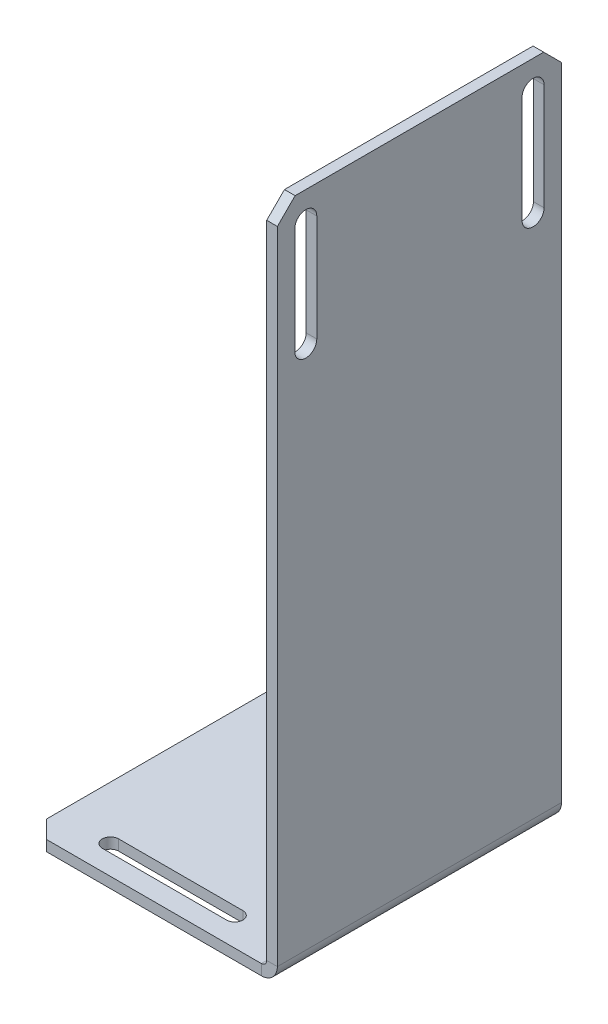
ISO-10303-21;
HEADER;
FILE_DESCRIPTION(('STEP AP214'),'2;1');
FILE_NAME('part.step','',(''),(''),'','','');
FILE_SCHEMA(('AUTOMOTIVE_DESIGN { 1 0 10303 214 1 1 1 1 }'));
ENDSEC;
DATA;
#1=APPLICATION_CONTEXT('core data for automotive mechanical design processes');
#2=APPLICATION_PROTOCOL_DEFINITION('international standard','automotive_design',2000,#1);
#3=PRODUCT_CONTEXT('',#1,'mechanical');
#4=PRODUCT('Part','Part','',(#3));
#5=PRODUCT_RELATED_PRODUCT_CATEGORY('part','',(#4));
#6=PRODUCT_DEFINITION_FORMATION('','',#4);
#7=PRODUCT_DEFINITION_CONTEXT('part definition',#1,'design');
#8=PRODUCT_DEFINITION('design','',#6,#7);
#9=PRODUCT_DEFINITION_SHAPE('','',#8);
#10=(LENGTH_UNIT() NAMED_UNIT(*) SI_UNIT(.MILLI.,.METRE.));
#11=(NAMED_UNIT(*) PLANE_ANGLE_UNIT() SI_UNIT($,.RADIAN.));
#12=(NAMED_UNIT(*) SI_UNIT($,.STERADIAN.) SOLID_ANGLE_UNIT());
#13=UNCERTAINTY_MEASURE_WITH_UNIT(LENGTH_MEASURE(1.E-05),#10,'distance_accuracy_value','');
#14=(GEOMETRIC_REPRESENTATION_CONTEXT(3) GLOBAL_UNCERTAINTY_ASSIGNED_CONTEXT((#13)) GLOBAL_UNIT_ASSIGNED_CONTEXT((#10,
#11,#12)) REPRESENTATION_CONTEXT('',''));
#15=CARTESIAN_POINT('',(0.,0.,0.));
#16=DIRECTION('',(0.,0.,1.));
#17=DIRECTION('',(1.,0.,0.));
#18=AXIS2_PLACEMENT_3D('',#15,#16,#17);
#19=CARTESIAN_POINT('',(0.,2.99999999999998,40.));
#20=DIRECTION('',(0.,-1.,0.));
#21=DIRECTION('',(1.,0.,0.));
#22=AXIS2_PLACEMENT_3D('',#19,#20,#21);
#23=PLANE('',#22);
#24=DIRECTION('',(-1.,0.,0.));
#25=VECTOR('',#24,1.);
#26=CARTESIAN_POINT('',(0.,2.99999999999998,-40.));
#27=LINE('',#26,#25);
#28=CARTESIAN_POINT('',(-4.50000000000002,3.00000000000003,-40.));
#29=VERTEX_POINT('',#28);
#30=CARTESIAN_POINT('',(-65.,2.99999999999998,-40.));
#31=VERTEX_POINT('',#30);
#32=EDGE_CURVE('E357',#29,#31,#27,.T.);
#33=ORIENTED_EDGE('',*,*,#32,.T.);
#34=DIRECTION('',(-0.707106781186548,0.,0.707106781186548));
#35=VECTOR('',#34,1.);
#36=CARTESIAN_POINT('',(-65.,2.99999999999998,-40.));
#37=LINE('',#36,#35);
#38=CARTESIAN_POINT('',(-70.,2.99999999999998,-35.));
#39=VERTEX_POINT('',#38);
#40=EDGE_CURVE('E434',#31,#39,#37,.T.);
#41=ORIENTED_EDGE('',*,*,#40,.T.);
#42=DIRECTION('',(0.,0.,-1.));
#43=VECTOR('',#42,1.);
#44=CARTESIAN_POINT('',(-70.,2.99999999999995,40.));
#45=LINE('',#44,#43);
#46=CARTESIAN_POINT('',(-70.,2.99999999999995,35.));
#47=VERTEX_POINT('',#46);
#48=EDGE_CURVE('E416',#47,#39,#45,.T.);
#49=ORIENTED_EDGE('',*,*,#48,.F.);
#50=DIRECTION('',(-0.707106781186549,0.,-0.707106781186546));
#51=VECTOR('',#50,1.);
#52=CARTESIAN_POINT('',(-70.,2.99999999999995,35.));
#53=LINE('',#52,#51);
#54=CARTESIAN_POINT('',(-65.,2.99999999999998,40.));
#55=VERTEX_POINT('',#54);
#56=EDGE_CURVE('E432',#47,#55,#53,.F.);
#57=ORIENTED_EDGE('',*,*,#56,.T.);
#58=DIRECTION('',(-1.,0.,0.));
#59=VECTOR('',#58,1.);
#60=CARTESIAN_POINT('',(0.,2.99999999999998,40.));
#61=LINE('',#60,#59);
#62=CARTESIAN_POINT('',(-4.50000000000003,3.00000000000003,40.));
#63=VERTEX_POINT('',#62);
#64=EDGE_CURVE('E364',#63,#55,#61,.T.);
#65=ORIENTED_EDGE('',*,*,#64,.F.);
#66=DIRECTION('',(0.,0.,-1.));
#67=VECTOR('',#66,1.);
#68=CARTESIAN_POINT('',(-4.50000000000003,3.00000000000003,40.));
#69=LINE('',#68,#67);
#70=EDGE_CURVE('E381',#63,#29,#69,.T.);
#71=ORIENTED_EDGE('',*,*,#70,.T.);
#72=EDGE_LOOP('',(#33,#41,#49,#57,#65,#71));
#73=FACE_BOUND('',#72,.T.);
#74=DIRECTION('',(1.,0.,0.));
#75=VECTOR('',#74,1.);
#76=CARTESIAN_POINT('',(-55.,2.99999999999998,-29.6999999999999));
#77=LINE('',#76,#75);
#78=CARTESIAN_POINT('',(-55.,2.99999999999998,-29.6999999999999));
#79=VERTEX_POINT('',#78);
#80=CARTESIAN_POINT('',(-20.,2.99999999999998,-29.6999999999999));
#81=VERTEX_POINT('',#80);
#82=EDGE_CURVE('E315',#79,#81,#77,.T.);
#83=ORIENTED_EDGE('',*,*,#82,.F.);
#84=CARTESIAN_POINT('',(-55.,2.99999999999998,-32.));
#85=DIRECTION('',(0.,1.,0.));
#86=DIRECTION('',(-1.,0.,0.));
#87=AXIS2_PLACEMENT_3D('',#84,#85,#86);
#88=CIRCLE('',#87,2.3);
#89=CARTESIAN_POINT('',(-55.,2.99999999999998,-34.3));
#90=VERTEX_POINT('',#89);
#91=EDGE_CURVE('E294',#90,#79,#88,.T.);
#92=ORIENTED_EDGE('',*,*,#91,.F.);
#93=DIRECTION('',(1.,0.,0.));
#94=VECTOR('',#93,1.);
#95=CARTESIAN_POINT('',(-55.,2.99999999999998,-34.3));
#96=LINE('',#95,#94);
#97=CARTESIAN_POINT('',(-20.,2.99999999999998,-34.3));
#98=VERTEX_POINT('',#97);
#99=EDGE_CURVE('E305',#90,#98,#96,.T.);
#100=ORIENTED_EDGE('',*,*,#99,.T.);
#101=CARTESIAN_POINT('',(-20.,2.99999999999998,-32.));
#102=DIRECTION('',(0.,1.,0.));
#103=DIRECTION('',(-1.,0.,0.));
#104=AXIS2_PLACEMENT_3D('',#101,#102,#103);
#105=CIRCLE('',#104,2.30000000000001);
#106=EDGE_CURVE('E318',#81,#98,#105,.T.);
#107=ORIENTED_EDGE('',*,*,#106,.F.);
#108=EDGE_LOOP('',(#83,#92,#100,#107));
#109=FACE_BOUND('',#108,.T.);
#110=CARTESIAN_POINT('',(-55.,3.,32.));
#111=DIRECTION('',(0.,-1.,0.));
#112=DIRECTION('',(-1.,0.,0.));
#113=AXIS2_PLACEMENT_3D('',#110,#111,#112);
#114=CIRCLE('',#113,2.3);
#115=CARTESIAN_POINT('',(-55.,3.,34.3));
#116=VERTEX_POINT('',#115);
#117=CARTESIAN_POINT('',(-55.,3.,29.7000000000001));
#118=VERTEX_POINT('',#117);
#119=EDGE_CURVE('E66',#116,#118,#114,.T.);
#120=ORIENTED_EDGE('',*,*,#119,.T.);
#121=DIRECTION('',(1.,0.,0.));
#122=VECTOR('',#121,1.);
#123=CARTESIAN_POINT('',(-55.,3.,29.7000000000001));
#124=LINE('',#123,#122);
#125=CARTESIAN_POINT('',(-20.,2.99999999999998,29.6999999999999));
#126=VERTEX_POINT('',#125);
#127=EDGE_CURVE('E251',#118,#126,#124,.T.);
#128=ORIENTED_EDGE('',*,*,#127,.T.);
#129=CARTESIAN_POINT('',(-20.,2.99999999999998,32.));
#130=DIRECTION('',(0.,-1.,0.));
#131=DIRECTION('',(-1.,0.,0.));
#132=AXIS2_PLACEMENT_3D('',#129,#130,#131);
#133=CIRCLE('',#132,2.30000000000001);
#134=CARTESIAN_POINT('',(-20.,2.99999999999998,34.3));
#135=VERTEX_POINT('',#134);
#136=EDGE_CURVE('E254',#126,#135,#133,.T.);
#137=ORIENTED_EDGE('',*,*,#136,.T.);
#138=DIRECTION('',(1.,0.,0.));
#139=VECTOR('',#138,1.);
#140=CARTESIAN_POINT('',(-55.,3.,34.3));
#141=LINE('',#140,#139);
#142=EDGE_CURVE('E260',#116,#135,#141,.T.);
#143=ORIENTED_EDGE('',*,*,#142,.F.);
#144=EDGE_LOOP('',(#120,#128,#137,#143));
#145=FACE_BOUND('',#144,.T.);
#146=ADVANCED_FACE('F51',(#73,#109,#145),#23,.F.);
#147=CARTESIAN_POINT('',(0.,0.,40.));
#148=DIRECTION('',(0.,-1.,0.));
#149=DIRECTION('',(1.,0.,0.));
#150=AXIS2_PLACEMENT_3D('',#147,#148,#149);
#151=PLANE('',#150);
#152=CARTESIAN_POINT('',(-55.,0.,-32.));
#153=DIRECTION('',(0.,1.,0.));
#154=DIRECTION('',(-1.,0.,0.));
#155=AXIS2_PLACEMENT_3D('',#152,#153,#154);
#156=CIRCLE('',#155,2.3);
#157=CARTESIAN_POINT('',(-55.,0.,-34.3));
#158=VERTEX_POINT('',#157);
#159=CARTESIAN_POINT('',(-55.,0.,-29.6999999999999));
#160=VERTEX_POINT('',#159);
#161=EDGE_CURVE('E301',#158,#160,#156,.T.);
#162=ORIENTED_EDGE('',*,*,#161,.T.);
#163=DIRECTION('',(1.,0.,0.));
#164=VECTOR('',#163,1.);
#165=CARTESIAN_POINT('',(-55.,0.,-29.6999999999999));
#166=LINE('',#165,#164);
#167=CARTESIAN_POINT('',(-20.,0.,-29.6999999999999));
#168=VERTEX_POINT('',#167);
#169=EDGE_CURVE('E304',#160,#168,#166,.T.);
#170=ORIENTED_EDGE('',*,*,#169,.T.);
#171=CARTESIAN_POINT('',(-20.,0.,-32.));
#172=DIRECTION('',(0.,1.,0.));
#173=DIRECTION('',(-1.,0.,0.));
#174=AXIS2_PLACEMENT_3D('',#171,#172,#173);
#175=CIRCLE('',#174,2.30000000000001);
#176=CARTESIAN_POINT('',(-20.,0.,-34.3));
#177=VERTEX_POINT('',#176);
#178=EDGE_CURVE('E308',#168,#177,#175,.T.);
#179=ORIENTED_EDGE('',*,*,#178,.T.);
#180=DIRECTION('',(1.,0.,0.));
#181=VECTOR('',#180,1.);
#182=CARTESIAN_POINT('',(-55.,0.,-34.3));
#183=LINE('',#182,#181);
#184=EDGE_CURVE('E311',#158,#177,#183,.T.);
#185=ORIENTED_EDGE('',*,*,#184,.F.);
#186=EDGE_LOOP('',(#162,#170,#179,#185));
#187=FACE_BOUND('',#186,.T.);
#188=DIRECTION('',(0.,0.,-1.));
#189=VECTOR('',#188,1.);
#190=CARTESIAN_POINT('',(-70.,0.,40.));
#191=LINE('',#190,#189);
#192=CARTESIAN_POINT('',(-70.,0.,35.));
#193=VERTEX_POINT('',#192);
#194=CARTESIAN_POINT('',(-70.,0.,-35.));
#195=VERTEX_POINT('',#194);
#196=EDGE_CURVE('E413',#193,#195,#191,.T.);
#197=ORIENTED_EDGE('',*,*,#196,.T.);
#198=DIRECTION('',(0.707106781186548,0.,-0.707106781186548));
#199=VECTOR('',#198,1.);
#200=CARTESIAN_POINT('',(-72.5,0.,-32.5));
#201=LINE('',#200,#199);
#202=CARTESIAN_POINT('',(-65.,0.,-40.));
#203=VERTEX_POINT('',#202);
#204=EDGE_CURVE('E443',#195,#203,#201,.T.);
#205=ORIENTED_EDGE('',*,*,#204,.T.);
#206=DIRECTION('',(-1.,0.,0.));
#207=VECTOR('',#206,1.);
#208=CARTESIAN_POINT('',(0.,0.,-40.));
#209=LINE('',#208,#207);
#210=CARTESIAN_POINT('',(-4.50000000000002,0.,-40.));
#211=VERTEX_POINT('',#210);
#212=EDGE_CURVE('E384',#211,#203,#209,.T.);
#213=ORIENTED_EDGE('',*,*,#212,.F.);
#214=DIRECTION('',(0.,0.,-1.));
#215=VECTOR('',#214,1.);
#216=CARTESIAN_POINT('',(-4.5,0.,40.));
#217=LINE('',#216,#215);
#218=CARTESIAN_POINT('',(-4.5,0.,40.));
#219=VERTEX_POINT('',#218);
#220=EDGE_CURVE('E410',#219,#211,#217,.T.);
#221=ORIENTED_EDGE('',*,*,#220,.F.);
#222=DIRECTION('',(-1.,0.,0.));
#223=VECTOR('',#222,1.);
#224=CARTESIAN_POINT('',(0.,0.,40.));
#225=LINE('',#224,#223);
#226=CARTESIAN_POINT('',(-65.,0.,40.));
#227=VERTEX_POINT('',#226);
#228=EDGE_CURVE('E367',#219,#227,#225,.T.);
#229=ORIENTED_EDGE('',*,*,#228,.T.);
#230=DIRECTION('',(0.707106781186549,0.,0.707106781186546));
#231=VECTOR('',#230,1.);
#232=CARTESIAN_POINT('',(-32.4999999999998,0.,72.5));
#233=LINE('',#232,#231);
#234=EDGE_CURVE('E441',#227,#193,#233,.F.);
#235=ORIENTED_EDGE('',*,*,#234,.T.);
#236=EDGE_LOOP('',(#197,#205,#213,#221,#229,#235));
#237=FACE_BOUND('',#236,.T.);
#238=DIRECTION('',(1.,0.,0.));
#239=VECTOR('',#238,1.);
#240=CARTESIAN_POINT('',(-55.,0.,29.7000000000001));
#241=LINE('',#240,#239);
#242=CARTESIAN_POINT('',(-55.,0.,29.7000000000001));
#243=VERTEX_POINT('',#242);
#244=CARTESIAN_POINT('',(-20.,0.,29.6999999999999));
#245=VERTEX_POINT('',#244);
#246=EDGE_CURVE('E240',#243,#245,#241,.T.);
#247=ORIENTED_EDGE('',*,*,#246,.F.);
#248=CARTESIAN_POINT('',(-55.,0.,32.));
#249=DIRECTION('',(0.,-1.,0.));
#250=DIRECTION('',(-1.,0.,0.));
#251=AXIS2_PLACEMENT_3D('',#248,#249,#250);
#252=CIRCLE('',#251,2.3);
#253=CARTESIAN_POINT('',(-55.,0.,34.3));
#254=VERTEX_POINT('',#253);
#255=EDGE_CURVE('E237',#254,#243,#252,.T.);
#256=ORIENTED_EDGE('',*,*,#255,.F.);
#257=DIRECTION('',(1.,0.,0.));
#258=VECTOR('',#257,1.);
#259=CARTESIAN_POINT('',(-55.,0.,34.3));
#260=LINE('',#259,#258);
#261=CARTESIAN_POINT('',(-20.,0.,34.3));
#262=VERTEX_POINT('',#261);
#263=EDGE_CURVE('E243',#254,#262,#260,.T.);
#264=ORIENTED_EDGE('',*,*,#263,.T.);
#265=CARTESIAN_POINT('',(-20.,0.,32.));
#266=DIRECTION('',(0.,-1.,0.));
#267=DIRECTION('',(-1.,0.,0.));
#268=AXIS2_PLACEMENT_3D('',#265,#266,#267);
#269=CIRCLE('',#268,2.30000000000001);
#270=EDGE_CURVE('E247',#245,#262,#269,.T.);
#271=ORIENTED_EDGE('',*,*,#270,.F.);
#272=EDGE_LOOP('',(#247,#256,#264,#271));
#273=FACE_BOUND('',#272,.T.);
#274=ADVANCED_FACE('F250',(#187,#237,#273),#151,.T.);
#275=CARTESIAN_POINT('',(0.,190.,40.));
#276=DIRECTION('',(1.,0.,0.));
#277=DIRECTION('',(0.,1.,0.));
#278=AXIS2_PLACEMENT_3D('',#275,#276,#277);
#279=PLANE('',#278);
#280=CARTESIAN_POINT('',(0.,182.,-32.));
#281=DIRECTION('',(-1.,0.,0.));
#282=DIRECTION('',(0.,-1.,0.));
#283=AXIS2_PLACEMENT_3D('',#280,#281,#282);
#284=CIRCLE('',#283,3.1);
#285=CARTESIAN_POINT('',(0.,182.,-28.9));
#286=VERTEX_POINT('',#285);
#287=CARTESIAN_POINT('',(0.,182.,-35.1));
#288=VERTEX_POINT('',#287);
#289=EDGE_CURVE('E332',#286,#288,#284,.T.);
#290=ORIENTED_EDGE('',*,*,#289,.T.);
#291=DIRECTION('',(0.,-1.,0.));
#292=VECTOR('',#291,1.);
#293=CARTESIAN_POINT('',(0.,182.,-35.1));
#294=LINE('',#293,#292);
#295=CARTESIAN_POINT('',(0.,152.,-35.1));
#296=VERTEX_POINT('',#295);
#297=EDGE_CURVE('E335',#288,#296,#294,.T.);
#298=ORIENTED_EDGE('',*,*,#297,.T.);
#299=CARTESIAN_POINT('',(0.,152.,-32.));
#300=DIRECTION('',(-1.,0.,0.));
#301=DIRECTION('',(0.,-1.,0.));
#302=AXIS2_PLACEMENT_3D('',#299,#300,#301);
#303=CIRCLE('',#302,3.1);
#304=CARTESIAN_POINT('',(0.,152.,-28.9));
#305=VERTEX_POINT('',#304);
#306=EDGE_CURVE('E339',#296,#305,#303,.T.);
#307=ORIENTED_EDGE('',*,*,#306,.T.);
#308=DIRECTION('',(0.,1.,0.));
#309=VECTOR('',#308,1.);
#310=CARTESIAN_POINT('',(0.,182.,-28.9));
#311=LINE('',#310,#309);
#312=EDGE_CURVE('E342',#305,#286,#311,.T.);
#313=ORIENTED_EDGE('',*,*,#312,.T.);
#314=EDGE_LOOP('',(#290,#298,#307,#313));
#315=FACE_BOUND('',#314,.T.);
#316=DIRECTION('',(0.,-1.,0.));
#317=VECTOR('',#316,1.);
#318=CARTESIAN_POINT('',(0.,190.,-40.));
#319=LINE('',#318,#317);
#320=CARTESIAN_POINT('',(0.,185.,-39.9999999999999));
#321=VERTEX_POINT('',#320);
#322=CARTESIAN_POINT('',(0.,4.49999999999998,-40.));
#323=VERTEX_POINT('',#322);
#324=EDGE_CURVE('E390',#321,#323,#319,.T.);
#325=ORIENTED_EDGE('',*,*,#324,.F.);
#326=DIRECTION('',(0.,-0.707106781186546,-0.707106781186549));
#327=VECTOR('',#326,1.);
#328=CARTESIAN_POINT('',(0.,227.5,2.50000000000028));
#329=LINE('',#328,#327);
#330=CARTESIAN_POINT('',(0.,190.,-34.9999999999999));
#331=VERTEX_POINT('',#330);
#332=EDGE_CURVE('E452',#321,#331,#329,.F.);
#333=ORIENTED_EDGE('',*,*,#332,.T.);
#334=DIRECTION('',(0.,0.,-1.));
#335=VECTOR('',#334,1.);
#336=CARTESIAN_POINT('',(0.,190.,40.));
#337=LINE('',#336,#335);
#338=CARTESIAN_POINT('',(0.,190.,35.));
#339=VERTEX_POINT('',#338);
#340=EDGE_CURVE('E404',#339,#331,#337,.T.);
#341=ORIENTED_EDGE('',*,*,#340,.F.);
#342=DIRECTION('',(0.,0.707106781186549,-0.707106781186546));
#343=VECTOR('',#342,1.);
#344=CARTESIAN_POINT('',(0.,187.5,37.5));
#345=LINE('',#344,#343);
#346=CARTESIAN_POINT('',(0.,185.,40.));
#347=VERTEX_POINT('',#346);
#348=EDGE_CURVE('E450',#339,#347,#345,.F.);
#349=ORIENTED_EDGE('',*,*,#348,.T.);
#350=DIRECTION('',(0.,-1.,0.));
#351=VECTOR('',#350,1.);
#352=CARTESIAN_POINT('',(0.,190.,40.));
#353=LINE('',#352,#351);
#354=CARTESIAN_POINT('',(0.,4.49999999999998,40.));
#355=VERTEX_POINT('',#354);
#356=EDGE_CURVE('E374',#347,#355,#353,.T.);
#357=ORIENTED_EDGE('',*,*,#356,.T.);
#358=DIRECTION('',(0.,0.,-1.));
#359=VECTOR('',#358,1.);
#360=CARTESIAN_POINT('',(0.,4.49999999999998,40.));
#361=LINE('',#360,#359);
#362=EDGE_CURVE('E407',#355,#323,#361,.T.);
#363=ORIENTED_EDGE('',*,*,#362,.T.);
#364=EDGE_LOOP('',(#325,#333,#341,#349,#357,#363));
#365=FACE_BOUND('',#364,.T.);
#366=DIRECTION('',(0.,-1.,0.));
#367=VECTOR('',#366,1.);
#368=CARTESIAN_POINT('',(0.,182.,35.1));
#369=LINE('',#368,#367);
#370=CARTESIAN_POINT('',(0.,182.,35.1));
#371=VERTEX_POINT('',#370);
#372=CARTESIAN_POINT('',(0.,152.,35.1));
#373=VERTEX_POINT('',#372);
#374=EDGE_CURVE('E278',#371,#373,#369,.T.);
#375=ORIENTED_EDGE('',*,*,#374,.F.);
#376=CARTESIAN_POINT('',(0.,182.,32.));
#377=DIRECTION('',(1.,0.,0.));
#378=DIRECTION('',(0.,-1.,0.));
#379=AXIS2_PLACEMENT_3D('',#376,#377,#378);
#380=CIRCLE('',#379,3.1);
#381=CARTESIAN_POINT('',(0.,182.,28.9));
#382=VERTEX_POINT('',#381);
#383=EDGE_CURVE('E270',#382,#371,#380,.T.);
#384=ORIENTED_EDGE('',*,*,#383,.F.);
#385=DIRECTION('',(0.,1.,0.));
#386=VECTOR('',#385,1.);
#387=CARTESIAN_POINT('',(0.,182.,28.9));
#388=LINE('',#387,#386);
#389=CARTESIAN_POINT('',(0.,152.,28.9));
#390=VERTEX_POINT('',#389);
#391=EDGE_CURVE('E272',#390,#382,#388,.T.);
#392=ORIENTED_EDGE('',*,*,#391,.F.);
#393=CARTESIAN_POINT('',(0.,152.,32.));
#394=DIRECTION('',(1.,0.,0.));
#395=DIRECTION('',(0.,-1.,0.));
#396=AXIS2_PLACEMENT_3D('',#393,#394,#395);
#397=CIRCLE('',#396,3.1);
#398=EDGE_CURVE('E275',#373,#390,#397,.T.);
#399=ORIENTED_EDGE('',*,*,#398,.F.);
#400=EDGE_LOOP('',(#375,#384,#392,#399));
#401=FACE_BOUND('',#400,.T.);
#402=ADVANCED_FACE('F477',(#315,#365,#401),#279,.T.);
#403=CARTESIAN_POINT('',(-3.00000000000003,190.,40.));
#404=DIRECTION('',(1.,0.,0.));
#405=DIRECTION('',(0.,1.,0.));
#406=AXIS2_PLACEMENT_3D('',#403,#404,#405);
#407=PLANE('',#406);
#408=DIRECTION('',(0.,0.,-1.));
#409=VECTOR('',#408,1.);
#410=CARTESIAN_POINT('',(-3.00000000000003,190.,40.));
#411=LINE('',#410,#409);
#412=CARTESIAN_POINT('',(-3.00000000000003,190.,35.));
#413=VERTEX_POINT('',#412);
#414=CARTESIAN_POINT('',(-3.00000000000003,190.,-34.9999999999999));
#415=VERTEX_POINT('',#414);
#416=EDGE_CURVE('E401',#413,#415,#411,.T.);
#417=ORIENTED_EDGE('',*,*,#416,.T.);
#418=DIRECTION('',(0.,0.707106781186546,0.707106781186549));
#419=VECTOR('',#418,1.);
#420=CARTESIAN_POINT('',(-3.00000000000003,185.,-40.));
#421=LINE('',#420,#419);
#422=CARTESIAN_POINT('',(-3.00000000000003,185.,-40.));
#423=VERTEX_POINT('',#422);
#424=EDGE_CURVE('E59',#415,#423,#421,.F.);
#425=ORIENTED_EDGE('',*,*,#424,.T.);
#426=DIRECTION('',(0.,-1.,0.));
#427=VECTOR('',#426,1.);
#428=CARTESIAN_POINT('',(-3.00000000000003,190.,-40.));
#429=LINE('',#428,#427);
#430=CARTESIAN_POINT('',(-3.00000000000003,4.49999999999998,-40.));
#431=VERTEX_POINT('',#430);
#432=EDGE_CURVE('E392',#423,#431,#429,.T.);
#433=ORIENTED_EDGE('',*,*,#432,.T.);
#434=DIRECTION('',(0.,0.,-1.));
#435=VECTOR('',#434,1.);
#436=CARTESIAN_POINT('',(-3.00000000000003,4.49999999999998,40.));
#437=LINE('',#436,#435);
#438=CARTESIAN_POINT('',(-3.00000000000003,4.49999999999998,40.));
#439=VERTEX_POINT('',#438);
#440=EDGE_CURVE('E398',#439,#431,#437,.T.);
#441=ORIENTED_EDGE('',*,*,#440,.F.);
#442=DIRECTION('',(0.,-1.,0.));
#443=VECTOR('',#442,1.);
#444=CARTESIAN_POINT('',(-3.00000000000003,190.,40.));
#445=LINE('',#444,#443);
#446=CARTESIAN_POINT('',(-3.00000000000002,185.,40.));
#447=VERTEX_POINT('',#446);
#448=EDGE_CURVE('E376',#447,#439,#445,.T.);
#449=ORIENTED_EDGE('',*,*,#448,.F.);
#450=DIRECTION('',(0.,-0.707106781186549,0.707106781186546));
#451=VECTOR('',#450,1.);
#452=CARTESIAN_POINT('',(-3.00000000000003,190.,35.));
#453=LINE('',#452,#451);
#454=EDGE_CURVE('E459',#447,#413,#453,.F.);
#455=ORIENTED_EDGE('',*,*,#454,.T.);
#456=EDGE_LOOP('',(#417,#425,#433,#441,#449,#455));
#457=FACE_BOUND('',#456,.T.);
#458=DIRECTION('',(0.,-1.,0.));
#459=VECTOR('',#458,1.);
#460=CARTESIAN_POINT('',(-3.00000000000004,182.,-35.1));
#461=LINE('',#460,#459);
#462=CARTESIAN_POINT('',(-3.00000000000003,182.,-35.1));
#463=VERTEX_POINT('',#462);
#464=CARTESIAN_POINT('',(-3.00000000000003,152.,-35.1));
#465=VERTEX_POINT('',#464);
#466=EDGE_CURVE('E347',#463,#465,#461,.T.);
#467=ORIENTED_EDGE('',*,*,#466,.F.);
#468=CARTESIAN_POINT('',(-3.00000000000004,182.,-32.));
#469=DIRECTION('',(-1.,0.,0.));
#470=DIRECTION('',(0.,-1.,0.));
#471=AXIS2_PLACEMENT_3D('',#468,#469,#470);
#472=CIRCLE('',#471,3.1);
#473=CARTESIAN_POINT('',(-3.00000000000004,182.,-28.9));
#474=VERTEX_POINT('',#473);
#475=EDGE_CURVE('E325',#474,#463,#472,.T.);
#476=ORIENTED_EDGE('',*,*,#475,.F.);
#477=DIRECTION('',(0.,1.,0.));
#478=VECTOR('',#477,1.);
#479=CARTESIAN_POINT('',(-3.00000000000004,182.,-28.9));
#480=LINE('',#479,#478);
#481=CARTESIAN_POINT('',(-3.00000000000003,152.,-28.9));
#482=VERTEX_POINT('',#481);
#483=EDGE_CURVE('E336',#482,#474,#480,.T.);
#484=ORIENTED_EDGE('',*,*,#483,.F.);
#485=CARTESIAN_POINT('',(-3.00000000000003,152.,-32.));
#486=DIRECTION('',(-1.,0.,0.));
#487=DIRECTION('',(0.,-1.,0.));
#488=AXIS2_PLACEMENT_3D('',#485,#486,#487);
#489=CIRCLE('',#488,3.1);
#490=EDGE_CURVE('E350',#465,#482,#489,.T.);
#491=ORIENTED_EDGE('',*,*,#490,.F.);
#492=EDGE_LOOP('',(#467,#476,#484,#491));
#493=FACE_BOUND('',#492,.T.);
#494=CARTESIAN_POINT('',(-3.00000000000004,182.,32.));
#495=DIRECTION('',(1.,0.,0.));
#496=DIRECTION('',(0.,-1.,0.));
#497=AXIS2_PLACEMENT_3D('',#494,#495,#496);
#498=CIRCLE('',#497,3.1);
#499=CARTESIAN_POINT('',(-3.00000000000004,182.,28.9));
#500=VERTEX_POINT('',#499);
#501=CARTESIAN_POINT('',(-3.00000000000004,182.,35.1));
#502=VERTEX_POINT('',#501);
#503=EDGE_CURVE('E266',#500,#502,#498,.T.);
#504=ORIENTED_EDGE('',*,*,#503,.T.);
#505=DIRECTION('',(0.,-1.,0.));
#506=VECTOR('',#505,1.);
#507=CARTESIAN_POINT('',(-3.00000000000004,182.,35.1));
#508=LINE('',#507,#506);
#509=CARTESIAN_POINT('',(-3.00000000000003,152.,35.1));
#510=VERTEX_POINT('',#509);
#511=EDGE_CURVE('E273',#502,#510,#508,.T.);
#512=ORIENTED_EDGE('',*,*,#511,.T.);
#513=CARTESIAN_POINT('',(-3.00000000000003,152.,32.));
#514=DIRECTION('',(1.,0.,0.));
#515=DIRECTION('',(0.,-1.,0.));
#516=AXIS2_PLACEMENT_3D('',#513,#514,#515);
#517=CIRCLE('',#516,3.1);
#518=CARTESIAN_POINT('',(-3.00000000000002,152.,28.9));
#519=VERTEX_POINT('',#518);
#520=EDGE_CURVE('E286',#510,#519,#517,.T.);
#521=ORIENTED_EDGE('',*,*,#520,.T.);
#522=DIRECTION('',(0.,1.,0.));
#523=VECTOR('',#522,1.);
#524=CARTESIAN_POINT('',(-3.00000000000004,182.,28.9));
#525=LINE('',#524,#523);
#526=EDGE_CURVE('E283',#519,#500,#525,.T.);
#527=ORIENTED_EDGE('',*,*,#526,.T.);
#528=EDGE_LOOP('',(#504,#512,#521,#527));
#529=FACE_BOUND('',#528,.T.);
#530=ADVANCED_FACE('F463',(#457,#493,#529),#407,.F.);
#531=CARTESIAN_POINT('',(-4.5,0.,40.));
#532=DIRECTION('',(0.,0.,1.));
#533=DIRECTION('',(1.,0.,0.));
#534=AXIS2_PLACEMENT_3D('',#531,#532,#533);
#535=PLANE('',#534);
#536=DIRECTION('',(0.,1.,0.));
#537=VECTOR('',#536,1.);
#538=CARTESIAN_POINT('',(-4.5,0.,40.));
#539=LINE('',#538,#537);
#540=EDGE_CURVE('E427',#219,#63,#539,.T.);
#541=ORIENTED_EDGE('',*,*,#540,.F.);
#542=CARTESIAN_POINT('',(-4.50000000000003,4.50000000000003,40.));
#543=DIRECTION('',(0.,0.,1.));
#544=DIRECTION('',(1.,0.,0.));
#545=AXIS2_PLACEMENT_3D('',#542,#543,#544);
#546=CIRCLE('',#545,4.5);
#547=EDGE_CURVE('E371',#355,#219,#546,.F.);
#548=ORIENTED_EDGE('',*,*,#547,.F.);
#549=DIRECTION('',(1.,0.,0.));
#550=VECTOR('',#549,1.);
#551=CARTESIAN_POINT('',(-3.00000000000003,4.49999999999998,40.));
#552=LINE('',#551,#550);
#553=EDGE_CURVE('E424',#439,#355,#552,.T.);
#554=ORIENTED_EDGE('',*,*,#553,.F.);
#555=CARTESIAN_POINT('',(-4.50000000000003,4.50000000000003,40.));
#556=DIRECTION('',(0.,0.,1.));
#557=DIRECTION('',(1.,0.,0.));
#558=AXIS2_PLACEMENT_3D('',#555,#556,#557);
#559=CIRCLE('',#558,1.5);
#560=EDGE_CURVE('E378',#439,#63,#559,.F.);
#561=ORIENTED_EDGE('',*,*,#560,.T.);
#562=EDGE_LOOP('',(#541,#548,#554,#561));
#563=FACE_BOUND('',#562,.T.);
#564=ADVANCED_FACE('F496',(#563),#535,.T.);
#565=CARTESIAN_POINT('',(-3.00000000000003,4.49999999999998,40.));
#566=DIRECTION('',(0.,0.,1.));
#567=DIRECTION('',(1.,0.,0.));
#568=AXIS2_PLACEMENT_3D('',#565,#566,#567);
#569=PLANE('',#568);
#570=ORIENTED_EDGE('',*,*,#64,.T.);
#571=DIRECTION('',(0.,-1.,0.));
#572=VECTOR('',#571,1.);
#573=CARTESIAN_POINT('',(-65.,4.49999999999998,40.));
#574=LINE('',#573,#572);
#575=EDGE_CURVE('E445',#55,#227,#574,.T.);
#576=ORIENTED_EDGE('',*,*,#575,.T.);
#577=ORIENTED_EDGE('',*,*,#228,.F.);
#578=ORIENTED_EDGE('',*,*,#540,.T.);
#579=EDGE_LOOP('',(#570,#576,#577,#578));
#580=FACE_BOUND('',#579,.T.);
#581=ADVANCED_FACE('F505',(#580),#569,.T.);
#582=CARTESIAN_POINT('',(0.,4.49999999999998,-40.));
#583=DIRECTION('',(0.,0.,-1.));
#584=DIRECTION('',(-1.,0.,0.));
#585=AXIS2_PLACEMENT_3D('',#582,#583,#584);
#586=PLANE('',#585);
#587=DIRECTION('',(-1.,0.,0.));
#588=VECTOR('',#587,1.);
#589=CARTESIAN_POINT('',(0.,4.49999999999998,-40.));
#590=LINE('',#589,#588);
#591=EDGE_CURVE('E421',#323,#431,#590,.T.);
#592=ORIENTED_EDGE('',*,*,#591,.F.);
#593=CARTESIAN_POINT('',(-4.50000000000003,4.50000000000003,-40.));
#594=DIRECTION('',(0.,0.,1.));
#595=DIRECTION('',(1.,0.,0.));
#596=AXIS2_PLACEMENT_3D('',#593,#594,#595);
#597=CIRCLE('',#596,4.5);
#598=EDGE_CURVE('E387',#323,#211,#597,.F.);
#599=ORIENTED_EDGE('',*,*,#598,.T.);
#600=DIRECTION('',(0.,-1.,0.));
#601=VECTOR('',#600,1.);
#602=CARTESIAN_POINT('',(-4.50000000000002,3.00000000000003,-40.));
#603=LINE('',#602,#601);
#604=EDGE_CURVE('E419',#29,#211,#603,.T.);
#605=ORIENTED_EDGE('',*,*,#604,.F.);
#606=CARTESIAN_POINT('',(-4.50000000000003,4.50000000000003,-40.));
#607=DIRECTION('',(0.,0.,1.));
#608=DIRECTION('',(1.,0.,0.));
#609=AXIS2_PLACEMENT_3D('',#606,#607,#608);
#610=CIRCLE('',#609,1.5);
#611=EDGE_CURVE('E368',#431,#29,#610,.F.);
#612=ORIENTED_EDGE('',*,*,#611,.F.);
#613=EDGE_LOOP('',(#592,#599,#605,#612));
#614=FACE_BOUND('',#613,.T.);
#615=ADVANCED_FACE('F525',(#614),#586,.T.);
#616=CARTESIAN_POINT('',(-4.50000000000002,3.00000000000003,-40.));
#617=DIRECTION('',(0.,0.,-1.));
#618=DIRECTION('',(-1.,0.,0.));
#619=AXIS2_PLACEMENT_3D('',#616,#617,#618);
#620=PLANE('',#619);
#621=ORIENTED_EDGE('',*,*,#432,.F.);
#622=DIRECTION('',(1.,0.,0.));
#623=VECTOR('',#622,1.);
#624=CARTESIAN_POINT('',(-4.50000000000002,185.,-40.));
#625=LINE('',#624,#623);
#626=EDGE_CURVE('E447',#423,#321,#625,.T.);
#627=ORIENTED_EDGE('',*,*,#626,.T.);
#628=ORIENTED_EDGE('',*,*,#324,.T.);
#629=ORIENTED_EDGE('',*,*,#591,.T.);
#630=EDGE_LOOP('',(#621,#627,#628,#629));
#631=FACE_BOUND('',#630,.T.);
#632=ADVANCED_FACE('F471',(#631),#620,.T.);
#633=CARTESIAN_POINT('',(-70.,0.,40.));
#634=DIRECTION('',(-1.,0.,0.));
#635=DIRECTION('',(0.,0.,1.));
#636=AXIS2_PLACEMENT_3D('',#633,#634,#635);
#637=PLANE('',#636);
#638=ORIENTED_EDGE('',*,*,#48,.T.);
#639=DIRECTION('',(0.,-1.,0.));
#640=VECTOR('',#639,1.);
#641=CARTESIAN_POINT('',(-70.,0.,-35.));
#642=LINE('',#641,#640);
#643=EDGE_CURVE('E439',#39,#195,#642,.T.);
#644=ORIENTED_EDGE('',*,*,#643,.T.);
#645=ORIENTED_EDGE('',*,*,#196,.F.);
#646=DIRECTION('',(0.,1.,0.));
#647=VECTOR('',#646,1.);
#648=CARTESIAN_POINT('',(-70.,0.,35.));
#649=LINE('',#648,#647);
#650=EDGE_CURVE('E436',#193,#47,#649,.T.);
#651=ORIENTED_EDGE('',*,*,#650,.T.);
#652=EDGE_LOOP('',(#638,#644,#645,#651));
#653=FACE_BOUND('',#652,.T.);
#654=ADVANCED_FACE('F514',(#653),#637,.T.);
#655=CARTESIAN_POINT('',(-4.50000000000003,4.50000000000003,40.));
#656=DIRECTION('',(0.,0.,-1.));
#657=DIRECTION('',(-1.,0.,0.));
#658=AXIS2_PLACEMENT_3D('',#655,#656,#657);
#659=CYLINDRICAL_SURFACE('',#658,4.5);
#660=ORIENTED_EDGE('',*,*,#598,.F.);
#661=ORIENTED_EDGE('',*,*,#362,.F.);
#662=ORIENTED_EDGE('',*,*,#547,.T.);
#663=ORIENTED_EDGE('',*,*,#220,.T.);
#664=EDGE_LOOP('',(#660,#661,#662,#663));
#665=FACE_BOUND('',#664,.T.);
#666=ADVANCED_FACE('F495',(#665),#659,.T.);
#667=CARTESIAN_POINT('',(-3.00000000000003,190.,40.));
#668=DIRECTION('',(0.,1.,0.));
#669=DIRECTION('',(0.,0.,1.));
#670=AXIS2_PLACEMENT_3D('',#667,#668,#669);
#671=PLANE('',#670);
#672=ORIENTED_EDGE('',*,*,#340,.T.);
#673=DIRECTION('',(-1.,0.,0.));
#674=VECTOR('',#673,1.);
#675=CARTESIAN_POINT('',(-3.00000000000003,190.,-34.9999999999999));
#676=LINE('',#675,#674);
#677=EDGE_CURVE('E457',#331,#415,#676,.T.);
#678=ORIENTED_EDGE('',*,*,#677,.T.);
#679=ORIENTED_EDGE('',*,*,#416,.F.);
#680=DIRECTION('',(1.,0.,0.));
#681=VECTOR('',#680,1.);
#682=CARTESIAN_POINT('',(-3.00000000000003,190.,35.));
#683=LINE('',#682,#681);
#684=EDGE_CURVE('E454',#413,#339,#683,.T.);
#685=ORIENTED_EDGE('',*,*,#684,.T.);
#686=EDGE_LOOP('',(#672,#678,#679,#685));
#687=FACE_BOUND('',#686,.T.);
#688=ADVANCED_FACE('F480',(#687),#671,.T.);
#689=CARTESIAN_POINT('',(-4.50000000000003,4.50000000000003,40.));
#690=DIRECTION('',(0.,0.,-1.));
#691=DIRECTION('',(-1.,0.,0.));
#692=AXIS2_PLACEMENT_3D('',#689,#690,#691);
#693=CYLINDRICAL_SURFACE('',#692,1.5);
#694=ORIENTED_EDGE('',*,*,#611,.T.);
#695=ORIENTED_EDGE('',*,*,#70,.F.);
#696=ORIENTED_EDGE('',*,*,#560,.F.);
#697=ORIENTED_EDGE('',*,*,#440,.T.);
#698=EDGE_LOOP('',(#694,#695,#696,#697));
#699=FACE_BOUND('',#698,.T.);
#700=ADVANCED_FACE('F527',(#699),#693,.F.);
#701=CARTESIAN_POINT('',(-4.50000000000003,4.50000000000003,40.));
#702=DIRECTION('',(0.,0.,1.));
#703=DIRECTION('',(1.,0.,0.));
#704=AXIS2_PLACEMENT_3D('',#701,#702,#703);
#705=PLANE('',#704);
#706=ORIENTED_EDGE('',*,*,#356,.F.);
#707=DIRECTION('',(-1.,0.,0.));
#708=VECTOR('',#707,1.);
#709=CARTESIAN_POINT('',(-4.5,185.,40.));
#710=LINE('',#709,#708);
#711=EDGE_CURVE('E13',#347,#447,#710,.T.);
#712=ORIENTED_EDGE('',*,*,#711,.T.);
#713=ORIENTED_EDGE('',*,*,#448,.T.);
#714=ORIENTED_EDGE('',*,*,#553,.T.);
#715=EDGE_LOOP('',(#706,#712,#713,#714));
#716=FACE_BOUND('',#715,.T.);
#717=ADVANCED_FACE('F487',(#716),#705,.T.);
#718=CARTESIAN_POINT('',(-4.50000000000003,4.50000000000003,-40.));
#719=DIRECTION('',(0.,0.,1.));
#720=DIRECTION('',(1.,0.,0.));
#721=AXIS2_PLACEMENT_3D('',#718,#719,#720);
#722=PLANE('',#721);
#723=ORIENTED_EDGE('',*,*,#212,.T.);
#724=DIRECTION('',(0.,1.,0.));
#725=VECTOR('',#724,1.);
#726=CARTESIAN_POINT('',(-65.,2.99999999999998,-40.));
#727=LINE('',#726,#725);
#728=EDGE_CURVE('E429',#203,#31,#727,.T.);
#729=ORIENTED_EDGE('',*,*,#728,.T.);
#730=ORIENTED_EDGE('',*,*,#32,.F.);
#731=ORIENTED_EDGE('',*,*,#604,.T.);
#732=EDGE_LOOP('',(#723,#729,#730,#731));
#733=FACE_BOUND('',#732,.T.);
#734=ADVANCED_FACE('F521',(#733),#722,.F.);
#735=CARTESIAN_POINT('',(-65.,4.49999999999998,-40.));
#736=DIRECTION('',(-0.707106781186547,0.,-0.707106781186547));
#737=DIRECTION('',(0.,-1.,0.));
#738=AXIS2_PLACEMENT_3D('',#735,#736,#737);
#739=PLANE('',#738);
#740=ORIENTED_EDGE('',*,*,#204,.F.);
#741=ORIENTED_EDGE('',*,*,#643,.F.);
#742=ORIENTED_EDGE('',*,*,#40,.F.);
#743=ORIENTED_EDGE('',*,*,#728,.F.);
#744=EDGE_LOOP('',(#740,#741,#742,#743));
#745=FACE_BOUND('',#744,.T.);
#746=ADVANCED_FACE('F518',(#745),#739,.T.);
#747=CARTESIAN_POINT('',(-70.,0.,35.));
#748=DIRECTION('',(0.707106781186545,0.,-0.707106781186549));
#749=DIRECTION('',(0.,1.,0.));
#750=AXIS2_PLACEMENT_3D('',#747,#748,#749);
#751=PLANE('',#750);
#752=ORIENTED_EDGE('',*,*,#234,.F.);
#753=ORIENTED_EDGE('',*,*,#575,.F.);
#754=ORIENTED_EDGE('',*,*,#56,.F.);
#755=ORIENTED_EDGE('',*,*,#650,.F.);
#756=EDGE_LOOP('',(#752,#753,#754,#755));
#757=FACE_BOUND('',#756,.T.);
#758=ADVANCED_FACE('F509',(#757),#751,.F.);
#759=CARTESIAN_POINT('',(-4.50000000000002,185.,-40.));
#760=DIRECTION('',(0.,-0.707106781186549,0.707106781186545));
#761=DIRECTION('',(1.,0.,0.));
#762=AXIS2_PLACEMENT_3D('',#759,#760,#761);
#763=PLANE('',#762);
#764=ORIENTED_EDGE('',*,*,#424,.F.);
#765=ORIENTED_EDGE('',*,*,#677,.F.);
#766=ORIENTED_EDGE('',*,*,#332,.F.);
#767=ORIENTED_EDGE('',*,*,#626,.F.);
#768=EDGE_LOOP('',(#764,#765,#766,#767));
#769=FACE_BOUND('',#768,.T.);
#770=ADVANCED_FACE('F474',(#769),#763,.F.);
#771=CARTESIAN_POINT('',(-3.00000000000003,190.,35.));
#772=DIRECTION('',(0.,-0.707106781186545,-0.707106781186549));
#773=DIRECTION('',(1.,0.,0.));
#774=AXIS2_PLACEMENT_3D('',#771,#772,#773);
#775=PLANE('',#774);
#776=ORIENTED_EDGE('',*,*,#454,.F.);
#777=ORIENTED_EDGE('',*,*,#711,.F.);
#778=ORIENTED_EDGE('',*,*,#348,.F.);
#779=ORIENTED_EDGE('',*,*,#684,.F.);
#780=EDGE_LOOP('',(#776,#777,#778,#779));
#781=FACE_BOUND('',#780,.T.);
#782=ADVANCED_FACE('F53',(#781),#775,.F.);
#783=CARTESIAN_POINT('',(0.,182.,-32.));
#784=DIRECTION('',(-1.,0.,0.));
#785=DIRECTION('',(0.,-1.,0.));
#786=AXIS2_PLACEMENT_3D('',#783,#784,#785);
#787=CYLINDRICAL_SURFACE('',#786,3.1);
#788=ORIENTED_EDGE('',*,*,#475,.T.);
#789=DIRECTION('',(-1.,0.,0.));
#790=VECTOR('',#789,1.);
#791=CARTESIAN_POINT('',(0.,182.,-35.1));
#792=LINE('',#791,#790);
#793=EDGE_CURVE('E345',#288,#463,#792,.T.);
#794=ORIENTED_EDGE('',*,*,#793,.F.);
#795=ORIENTED_EDGE('',*,*,#289,.F.);
#796=DIRECTION('',(-1.,0.,0.));
#797=VECTOR('',#796,1.);
#798=CARTESIAN_POINT('',(0.,182.,-28.9));
#799=LINE('',#798,#797);
#800=EDGE_CURVE('E355',#286,#474,#799,.T.);
#801=ORIENTED_EDGE('',*,*,#800,.T.);
#802=EDGE_LOOP('',(#788,#794,#795,#801));
#803=FACE_BOUND('',#802,.T.);
#804=ADVANCED_FACE('F590',(#803),#787,.F.);
#805=CARTESIAN_POINT('',(0.,182.,-28.9));
#806=DIRECTION('',(0.,0.,1.));
#807=DIRECTION('',(0.,-1.,0.));
#808=AXIS2_PLACEMENT_3D('',#805,#806,#807);
#809=PLANE('',#808);
#810=ORIENTED_EDGE('',*,*,#483,.T.);
#811=ORIENTED_EDGE('',*,*,#800,.F.);
#812=ORIENTED_EDGE('',*,*,#312,.F.);
#813=DIRECTION('',(-1.,0.,0.));
#814=VECTOR('',#813,1.);
#815=CARTESIAN_POINT('',(0.,152.,-28.9));
#816=LINE('',#815,#814);
#817=EDGE_CURVE('E358',#305,#482,#816,.T.);
#818=ORIENTED_EDGE('',*,*,#817,.T.);
#819=EDGE_LOOP('',(#810,#811,#812,#818));
#820=FACE_BOUND('',#819,.T.);
#821=ADVANCED_FACE('F586',(#820),#809,.F.);
#822=CARTESIAN_POINT('',(0.,152.,-32.));
#823=DIRECTION('',(-1.,0.,0.));
#824=DIRECTION('',(0.,-1.,0.));
#825=AXIS2_PLACEMENT_3D('',#822,#823,#824);
#826=CYLINDRICAL_SURFACE('',#825,3.1);
#827=ORIENTED_EDGE('',*,*,#490,.T.);
#828=ORIENTED_EDGE('',*,*,#817,.F.);
#829=ORIENTED_EDGE('',*,*,#306,.F.);
#830=DIRECTION('',(-1.,0.,0.));
#831=VECTOR('',#830,1.);
#832=CARTESIAN_POINT('',(0.,152.,-35.1));
#833=LINE('',#832,#831);
#834=EDGE_CURVE('E360',#296,#465,#833,.T.);
#835=ORIENTED_EDGE('',*,*,#834,.T.);
#836=EDGE_LOOP('',(#827,#828,#829,#835));
#837=FACE_BOUND('',#836,.T.);
#838=ADVANCED_FACE('F589',(#837),#826,.F.);
#839=CARTESIAN_POINT('',(0.,182.,-35.1));
#840=DIRECTION('',(0.,0.,-1.));
#841=DIRECTION('',(-1.,0.,0.));
#842=AXIS2_PLACEMENT_3D('',#839,#840,#841);
#843=PLANE('',#842);
#844=ORIENTED_EDGE('',*,*,#466,.T.);
#845=ORIENTED_EDGE('',*,*,#834,.F.);
#846=ORIENTED_EDGE('',*,*,#297,.F.);
#847=ORIENTED_EDGE('',*,*,#793,.T.);
#848=EDGE_LOOP('',(#844,#845,#846,#847));
#849=FACE_BOUND('',#848,.T.);
#850=ADVANCED_FACE('F584',(#849),#843,.F.);
#851=CARTESIAN_POINT('',(-55.,0.,-32.));
#852=DIRECTION('',(0.,1.,0.));
#853=DIRECTION('',(-1.,0.,0.));
#854=AXIS2_PLACEMENT_3D('',#851,#852,#853);
#855=CYLINDRICAL_SURFACE('',#854,2.3);
#856=ORIENTED_EDGE('',*,*,#91,.T.);
#857=DIRECTION('',(0.,1.,0.));
#858=VECTOR('',#857,1.);
#859=CARTESIAN_POINT('',(-55.,0.,-29.6999999999999));
#860=LINE('',#859,#858);
#861=EDGE_CURVE('E313',#160,#79,#860,.T.);
#862=ORIENTED_EDGE('',*,*,#861,.F.);
#863=ORIENTED_EDGE('',*,*,#161,.F.);
#864=DIRECTION('',(0.,1.,0.));
#865=VECTOR('',#864,1.);
#866=CARTESIAN_POINT('',(-55.,0.,-34.3));
#867=LINE('',#866,#865);
#868=EDGE_CURVE('E323',#158,#90,#867,.T.);
#869=ORIENTED_EDGE('',*,*,#868,.T.);
#870=EDGE_LOOP('',(#856,#862,#863,#869));
#871=FACE_BOUND('',#870,.T.);
#872=ADVANCED_FACE('F574',(#871),#855,.F.);
#873=CARTESIAN_POINT('',(-55.,0.,-34.3));
#874=DIRECTION('',(0.,0.,1.));
#875=DIRECTION('',(1.,0.,0.));
#876=AXIS2_PLACEMENT_3D('',#873,#874,#875);
#877=PLANE('',#876);
#878=ORIENTED_EDGE('',*,*,#99,.F.);
#879=ORIENTED_EDGE('',*,*,#868,.F.);
#880=ORIENTED_EDGE('',*,*,#184,.T.);
#881=DIRECTION('',(0.,1.,0.));
#882=VECTOR('',#881,1.);
#883=CARTESIAN_POINT('',(-20.,0.,-34.3));
#884=LINE('',#883,#882);
#885=EDGE_CURVE('E326',#177,#98,#884,.T.);
#886=ORIENTED_EDGE('',*,*,#885,.T.);
#887=EDGE_LOOP('',(#878,#879,#880,#886));
#888=FACE_BOUND('',#887,.T.);
#889=ADVANCED_FACE('F570',(#888),#877,.T.);
#890=CARTESIAN_POINT('',(-20.,0.,-32.));
#891=DIRECTION('',(0.,1.,0.));
#892=DIRECTION('',(-1.,0.,0.));
#893=AXIS2_PLACEMENT_3D('',#890,#891,#892);
#894=CYLINDRICAL_SURFACE('',#893,2.30000000000001);
#895=ORIENTED_EDGE('',*,*,#106,.T.);
#896=ORIENTED_EDGE('',*,*,#885,.F.);
#897=ORIENTED_EDGE('',*,*,#178,.F.);
#898=DIRECTION('',(0.,1.,0.));
#899=VECTOR('',#898,1.);
#900=CARTESIAN_POINT('',(-20.,0.,-29.6999999999999));
#901=LINE('',#900,#899);
#902=EDGE_CURVE('E328',#168,#81,#901,.T.);
#903=ORIENTED_EDGE('',*,*,#902,.T.);
#904=EDGE_LOOP('',(#895,#896,#897,#903));
#905=FACE_BOUND('',#904,.T.);
#906=ADVANCED_FACE('F573',(#905),#894,.F.);
#907=CARTESIAN_POINT('',(-55.,0.,-29.6999999999999));
#908=DIRECTION('',(0.,0.,1.));
#909=DIRECTION('',(1.,0.,0.));
#910=AXIS2_PLACEMENT_3D('',#907,#908,#909);
#911=PLANE('',#910);
#912=ORIENTED_EDGE('',*,*,#82,.T.);
#913=ORIENTED_EDGE('',*,*,#902,.F.);
#914=ORIENTED_EDGE('',*,*,#169,.F.);
#915=ORIENTED_EDGE('',*,*,#861,.T.);
#916=EDGE_LOOP('',(#912,#913,#914,#915));
#917=FACE_BOUND('',#916,.T.);
#918=ADVANCED_FACE('F568',(#917),#911,.F.);
#919=CARTESIAN_POINT('',(0.,182.,32.));
#920=DIRECTION('',(-1.,0.,0.));
#921=DIRECTION('',(0.,-1.,0.));
#922=AXIS2_PLACEMENT_3D('',#919,#920,#921);
#923=CYLINDRICAL_SURFACE('',#922,3.1);
#924=ORIENTED_EDGE('',*,*,#503,.F.);
#925=DIRECTION('',(-1.,0.,0.));
#926=VECTOR('',#925,1.);
#927=CARTESIAN_POINT('',(0.,182.,28.9));
#928=LINE('',#927,#926);
#929=EDGE_CURVE('E280',#382,#500,#928,.T.);
#930=ORIENTED_EDGE('',*,*,#929,.F.);
#931=ORIENTED_EDGE('',*,*,#383,.T.);
#932=DIRECTION('',(-1.,0.,0.));
#933=VECTOR('',#932,1.);
#934=CARTESIAN_POINT('',(0.,182.,35.1));
#935=LINE('',#934,#933);
#936=EDGE_CURVE('E291',#371,#502,#935,.T.);
#937=ORIENTED_EDGE('',*,*,#936,.T.);
#938=EDGE_LOOP('',(#924,#930,#931,#937));
#939=FACE_BOUND('',#938,.T.);
#940=ADVANCED_FACE('F558',(#939),#923,.F.);
#941=CARTESIAN_POINT('',(0.,182.,35.1));
#942=DIRECTION('',(0.,0.,-1.));
#943=DIRECTION('',(-1.,0.,0.));
#944=AXIS2_PLACEMENT_3D('',#941,#942,#943);
#945=PLANE('',#944);
#946=ORIENTED_EDGE('',*,*,#511,.F.);
#947=ORIENTED_EDGE('',*,*,#936,.F.);
#948=ORIENTED_EDGE('',*,*,#374,.T.);
#949=DIRECTION('',(-1.,0.,0.));
#950=VECTOR('',#949,1.);
#951=CARTESIAN_POINT('',(0.,152.,35.1));
#952=LINE('',#951,#950);
#953=EDGE_CURVE('E295',#373,#510,#952,.T.);
#954=ORIENTED_EDGE('',*,*,#953,.T.);
#955=EDGE_LOOP('',(#946,#947,#948,#954));
#956=FACE_BOUND('',#955,.T.);
#957=ADVANCED_FACE('F554',(#956),#945,.T.);
#958=CARTESIAN_POINT('',(0.,152.,32.));
#959=DIRECTION('',(-1.,0.,0.));
#960=DIRECTION('',(0.,-1.,0.));
#961=AXIS2_PLACEMENT_3D('',#958,#959,#960);
#962=CYLINDRICAL_SURFACE('',#961,3.1);
#963=ORIENTED_EDGE('',*,*,#520,.F.);
#964=ORIENTED_EDGE('',*,*,#953,.F.);
#965=ORIENTED_EDGE('',*,*,#398,.T.);
#966=DIRECTION('',(-1.,0.,0.));
#967=VECTOR('',#966,1.);
#968=CARTESIAN_POINT('',(0.,152.,28.9));
#969=LINE('',#968,#967);
#970=EDGE_CURVE('E297',#390,#519,#969,.T.);
#971=ORIENTED_EDGE('',*,*,#970,.T.);
#972=EDGE_LOOP('',(#963,#964,#965,#971));
#973=FACE_BOUND('',#972,.T.);
#974=ADVANCED_FACE('F557',(#973),#962,.F.);
#975=CARTESIAN_POINT('',(0.,182.,28.9));
#976=DIRECTION('',(0.,0.,1.));
#977=DIRECTION('',(0.,-1.,0.));
#978=AXIS2_PLACEMENT_3D('',#975,#976,#977);
#979=PLANE('',#978);
#980=ORIENTED_EDGE('',*,*,#526,.F.);
#981=ORIENTED_EDGE('',*,*,#970,.F.);
#982=ORIENTED_EDGE('',*,*,#391,.T.);
#983=ORIENTED_EDGE('',*,*,#929,.T.);
#984=EDGE_LOOP('',(#980,#981,#982,#983));
#985=FACE_BOUND('',#984,.T.);
#986=ADVANCED_FACE('F549',(#985),#979,.T.);
#987=CARTESIAN_POINT('',(-55.,0.,32.));
#988=DIRECTION('',(0.,1.,0.));
#989=DIRECTION('',(-1.,0.,0.));
#990=AXIS2_PLACEMENT_3D('',#987,#988,#989);
#991=CYLINDRICAL_SURFACE('',#990,2.3);
#992=ORIENTED_EDGE('',*,*,#119,.F.);
#993=DIRECTION('',(0.,1.,0.));
#994=VECTOR('',#993,1.);
#995=CARTESIAN_POINT('',(-55.,0.,34.3));
#996=LINE('',#995,#994);
#997=EDGE_CURVE('E234',#254,#116,#996,.T.);
#998=ORIENTED_EDGE('',*,*,#997,.F.);
#999=ORIENTED_EDGE('',*,*,#255,.T.);
#1000=DIRECTION('',(0.,1.,0.));
#1001=VECTOR('',#1000,1.);
#1002=CARTESIAN_POINT('',(-55.,0.,29.7000000000001));
#1003=LINE('',#1002,#1001);
#1004=EDGE_CURVE('E264',#243,#118,#1003,.T.);
#1005=ORIENTED_EDGE('',*,*,#1004,.T.);
#1006=EDGE_LOOP('',(#992,#998,#999,#1005));
#1007=FACE_BOUND('',#1006,.T.);
#1008=ADVANCED_FACE('F235',(#1007),#991,.F.);
#1009=CARTESIAN_POINT('',(-55.,0.,29.7000000000001));
#1010=DIRECTION('',(0.,0.,1.));
#1011=DIRECTION('',(1.,0.,0.));
#1012=AXIS2_PLACEMENT_3D('',#1009,#1010,#1011);
#1013=PLANE('',#1012);
#1014=ORIENTED_EDGE('',*,*,#127,.F.);
#1015=ORIENTED_EDGE('',*,*,#1004,.F.);
#1016=ORIENTED_EDGE('',*,*,#246,.T.);
#1017=DIRECTION('',(0.,1.,0.));
#1018=VECTOR('',#1017,1.);
#1019=CARTESIAN_POINT('',(-20.,0.,29.6999999999999));
#1020=LINE('',#1019,#1018);
#1021=EDGE_CURVE('E267',#245,#126,#1020,.T.);
#1022=ORIENTED_EDGE('',*,*,#1021,.T.);
#1023=EDGE_LOOP('',(#1014,#1015,#1016,#1022));
#1024=FACE_BOUND('',#1023,.T.);
#1025=ADVANCED_FACE('F541',(#1024),#1013,.T.);
#1026=CARTESIAN_POINT('',(-20.,0.,32.));
#1027=DIRECTION('',(0.,1.,0.));
#1028=DIRECTION('',(-1.,0.,0.));
#1029=AXIS2_PLACEMENT_3D('',#1026,#1027,#1028);
#1030=CYLINDRICAL_SURFACE('',#1029,2.30000000000001);
#1031=ORIENTED_EDGE('',*,*,#136,.F.);
#1032=ORIENTED_EDGE('',*,*,#1021,.F.);
#1033=ORIENTED_EDGE('',*,*,#270,.T.);
#1034=DIRECTION('',(0.,1.,0.));
#1035=VECTOR('',#1034,1.);
#1036=CARTESIAN_POINT('',(-20.,0.,34.3));
#1037=LINE('',#1036,#1035);
#1038=EDGE_CURVE('E74',#262,#135,#1037,.T.);
#1039=ORIENTED_EDGE('',*,*,#1038,.T.);
#1040=EDGE_LOOP('',(#1031,#1032,#1033,#1039));
#1041=FACE_BOUND('',#1040,.T.);
#1042=ADVANCED_FACE('F539',(#1041),#1030,.F.);
#1043=CARTESIAN_POINT('',(-55.,0.,34.3));
#1044=DIRECTION('',(0.,0.,1.));
#1045=DIRECTION('',(1.,0.,0.));
#1046=AXIS2_PLACEMENT_3D('',#1043,#1044,#1045);
#1047=PLANE('',#1046);
#1048=ORIENTED_EDGE('',*,*,#142,.T.);
#1049=ORIENTED_EDGE('',*,*,#1038,.F.);
#1050=ORIENTED_EDGE('',*,*,#263,.F.);
#1051=ORIENTED_EDGE('',*,*,#997,.T.);
#1052=EDGE_LOOP('',(#1048,#1049,#1050,#1051));
#1053=FACE_BOUND('',#1052,.T.);
#1054=ADVANCED_FACE('F244',(#1053),#1047,.F.);
#1055=CLOSED_SHELL('',(#146,#274,#402,#530,#564,#581,#615,#632,#654,#666,#688,#700,#717,#734,
#746,#758,#770,#782,#804,#821,#838,#850,#872,#889,#906,#918,#940,#957,#974,#986,#1008,#1025,
#1042,#1054));
#1056=MANIFOLD_SOLID_BREP('B2',#1055);
#1057=ADVANCED_BREP_SHAPE_REPRESENTATION('',(#18,#1056),#14);
#1058=SHAPE_DEFINITION_REPRESENTATION(#9,#1057);
ENDSEC;
END-ISO-10303-21;
